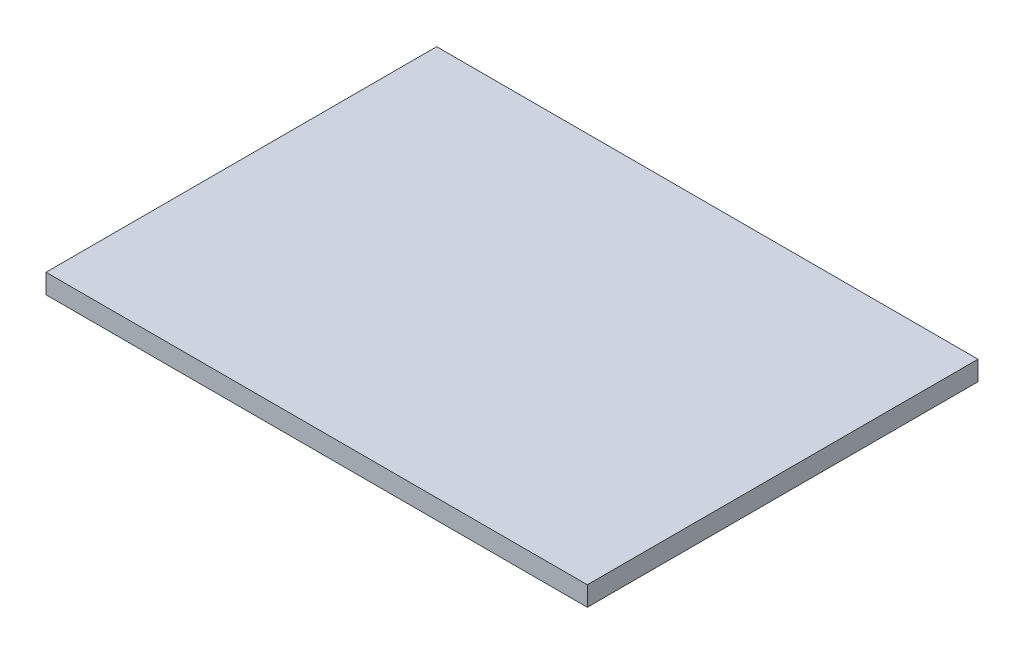
ISO-10303-21;
HEADER;
FILE_DESCRIPTION(('STEP AP214'),'2;1');
FILE_NAME('part.step','',(''),(''),'','','');
FILE_SCHEMA(('AUTOMOTIVE_DESIGN { 1 0 10303 214 1 1 1 1 }'));
ENDSEC;
DATA;
#1=APPLICATION_CONTEXT('core data for automotive mechanical design processes');
#2=APPLICATION_PROTOCOL_DEFINITION('international standard','automotive_design',2000,#1);
#3=PRODUCT_CONTEXT('',#1,'mechanical');
#4=PRODUCT('Part','Part','',(#3));
#5=PRODUCT_RELATED_PRODUCT_CATEGORY('part','',(#4));
#6=PRODUCT_DEFINITION_FORMATION('','',#4);
#7=PRODUCT_DEFINITION_CONTEXT('part definition',#1,'design');
#8=PRODUCT_DEFINITION('design','',#6,#7);
#9=PRODUCT_DEFINITION_SHAPE('','',#8);
#10=(LENGTH_UNIT() NAMED_UNIT(*) SI_UNIT(.MILLI.,.METRE.));
#11=(NAMED_UNIT(*) PLANE_ANGLE_UNIT() SI_UNIT($,.RADIAN.));
#12=(NAMED_UNIT(*) SI_UNIT($,.STERADIAN.) SOLID_ANGLE_UNIT());
#13=UNCERTAINTY_MEASURE_WITH_UNIT(LENGTH_MEASURE(1.E-05),#10,'distance_accuracy_value','');
#14=(GEOMETRIC_REPRESENTATION_CONTEXT(3) GLOBAL_UNCERTAINTY_ASSIGNED_CONTEXT((#13)) GLOBAL_UNIT_ASSIGNED_CONTEXT((#10,
#11,#12)) REPRESENTATION_CONTEXT('',''));
#15=CARTESIAN_POINT('',(0.,0.,0.));
#16=DIRECTION('',(0.,0.,1.));
#17=DIRECTION('',(1.,0.,0.));
#18=AXIS2_PLACEMENT_3D('',#15,#16,#17);
#19=CARTESIAN_POINT('',(-175.97628,6.35,-127.));
#20=DIRECTION('',(0.,0.,-1.));
#21=DIRECTION('',(-1.,0.,0.));
#22=AXIS2_PLACEMENT_3D('',#19,#20,#21);
#23=PLANE('',#22);
#24=DIRECTION('',(1.,0.,0.));
#25=VECTOR('',#24,1.);
#26=CARTESIAN_POINT('',(-175.97628,0.,-127.));
#27=LINE('',#26,#25);
#28=CARTESIAN_POINT('',(-175.97628,0.,-127.));
#29=VERTEX_POINT('',#28);
#30=CARTESIAN_POINT('',(0.,0.,-127.));
#31=VERTEX_POINT('',#30);
#32=EDGE_CURVE('E98',#29,#31,#27,.T.);
#33=ORIENTED_EDGE('',*,*,#32,.F.);
#34=DIRECTION('',(0.,-1.,0.));
#35=VECTOR('',#34,1.);
#36=CARTESIAN_POINT('',(-175.97628,6.35,-127.));
#37=LINE('',#36,#35);
#38=CARTESIAN_POINT('',(-175.97628,6.35,-127.));
#39=VERTEX_POINT('',#38);
#40=EDGE_CURVE('E11',#39,#29,#37,.T.);
#41=ORIENTED_EDGE('',*,*,#40,.F.);
#42=DIRECTION('',(1.,0.,0.));
#43=VECTOR('',#42,1.);
#44=CARTESIAN_POINT('',(-175.97628,6.35,-127.));
#45=LINE('',#44,#43);
#46=CARTESIAN_POINT('',(0.,6.35,-127.));
#47=VERTEX_POINT('',#46);
#48=EDGE_CURVE('E92',#39,#47,#45,.T.);
#49=ORIENTED_EDGE('',*,*,#48,.T.);
#50=DIRECTION('',(0.,-1.,0.));
#51=VECTOR('',#50,1.);
#52=CARTESIAN_POINT('',(0.,6.35,-127.));
#53=LINE('',#52,#51);
#54=EDGE_CURVE('E37',#47,#31,#53,.T.);
#55=ORIENTED_EDGE('',*,*,#54,.T.);
#56=EDGE_LOOP('',(#33,#41,#49,#55));
#57=FACE_BOUND('',#56,.T.);
#58=ADVANCED_FACE('F34',(#57),#23,.T.);
#59=CARTESIAN_POINT('',(-175.97628,6.35,0.));
#60=DIRECTION('',(-1.,0.,0.));
#61=DIRECTION('',(0.,0.,1.));
#62=AXIS2_PLACEMENT_3D('',#59,#60,#61);
#63=PLANE('',#62);
#64=DIRECTION('',(0.,0.,-1.));
#65=VECTOR('',#64,1.);
#66=CARTESIAN_POINT('',(-175.97628,0.,0.));
#67=LINE('',#66,#65);
#68=CARTESIAN_POINT('',(-175.97628,0.,0.));
#69=VERTEX_POINT('',#68);
#70=EDGE_CURVE('E94',#69,#29,#67,.T.);
#71=ORIENTED_EDGE('',*,*,#70,.F.);
#72=DIRECTION('',(0.,-1.,0.));
#73=VECTOR('',#72,1.);
#74=CARTESIAN_POINT('',(-175.97628,6.35,0.));
#75=LINE('',#74,#73);
#76=CARTESIAN_POINT('',(-175.97628,6.35,0.));
#77=VERTEX_POINT('',#76);
#78=EDGE_CURVE('E43',#77,#69,#75,.T.);
#79=ORIENTED_EDGE('',*,*,#78,.F.);
#80=DIRECTION('',(0.,0.,-1.));
#81=VECTOR('',#80,1.);
#82=CARTESIAN_POINT('',(-175.97628,6.35,0.));
#83=LINE('',#82,#81);
#84=EDGE_CURVE('E89',#77,#39,#83,.T.);
#85=ORIENTED_EDGE('',*,*,#84,.T.);
#86=ORIENTED_EDGE('',*,*,#40,.T.);
#87=EDGE_LOOP('',(#71,#79,#85,#86));
#88=FACE_BOUND('',#87,.T.);
#89=ADVANCED_FACE('F108',(#88),#63,.T.);
#90=CARTESIAN_POINT('',(0.,6.35,0.));
#91=DIRECTION('',(0.,0.,1.));
#92=DIRECTION('',(1.,0.,0.));
#93=AXIS2_PLACEMENT_3D('',#90,#91,#92);
#94=PLANE('',#93);
#95=DIRECTION('',(-1.,0.,0.));
#96=VECTOR('',#95,1.);
#97=CARTESIAN_POINT('',(0.,0.,0.));
#98=LINE('',#97,#96);
#99=CARTESIAN_POINT('',(0.,0.,0.));
#100=VERTEX_POINT('',#99);
#101=EDGE_CURVE('E84',#100,#69,#98,.T.);
#102=ORIENTED_EDGE('',*,*,#101,.F.);
#103=DIRECTION('',(0.,-1.,0.));
#104=VECTOR('',#103,1.);
#105=CARTESIAN_POINT('',(0.,6.35,0.));
#106=LINE('',#105,#104);
#107=CARTESIAN_POINT('',(0.,6.35,0.));
#108=VERTEX_POINT('',#107);
#109=EDGE_CURVE('E79',#108,#100,#106,.T.);
#110=ORIENTED_EDGE('',*,*,#109,.F.);
#111=DIRECTION('',(-1.,0.,0.));
#112=VECTOR('',#111,1.);
#113=CARTESIAN_POINT('',(0.,6.35,0.));
#114=LINE('',#113,#112);
#115=EDGE_CURVE('E82',#108,#77,#114,.T.);
#116=ORIENTED_EDGE('',*,*,#115,.T.);
#117=ORIENTED_EDGE('',*,*,#78,.T.);
#118=EDGE_LOOP('',(#102,#110,#116,#117));
#119=FACE_BOUND('',#118,.T.);
#120=ADVANCED_FACE('F81',(#119),#94,.T.);
#121=CARTESIAN_POINT('',(0.,6.35,-127.));
#122=DIRECTION('',(1.,0.,0.));
#123=DIRECTION('',(0.,0.,-1.));
#124=AXIS2_PLACEMENT_3D('',#121,#122,#123);
#125=PLANE('',#124);
#126=DIRECTION('',(0.,0.,1.));
#127=VECTOR('',#126,1.);
#128=CARTESIAN_POINT('',(0.,0.,-127.));
#129=LINE('',#128,#127);
#130=EDGE_CURVE('E101',#31,#100,#129,.T.);
#131=ORIENTED_EDGE('',*,*,#130,.F.);
#132=ORIENTED_EDGE('',*,*,#54,.F.);
#133=DIRECTION('',(0.,0.,1.));
#134=VECTOR('',#133,1.);
#135=CARTESIAN_POINT('',(0.,6.35,-127.));
#136=LINE('',#135,#134);
#137=EDGE_CURVE('E88',#47,#108,#136,.T.);
#138=ORIENTED_EDGE('',*,*,#137,.T.);
#139=ORIENTED_EDGE('',*,*,#109,.T.);
#140=EDGE_LOOP('',(#131,#132,#138,#139));
#141=FACE_BOUND('',#140,.T.);
#142=ADVANCED_FACE('F91',(#141),#125,.T.);
#143=CARTESIAN_POINT('',(0.,6.35,0.));
#144=DIRECTION('',(0.,-1.,0.));
#145=DIRECTION('',(0.,0.,-1.));
#146=AXIS2_PLACEMENT_3D('',#143,#144,#145);
#147=PLANE('',#146);
#148=ORIENTED_EDGE('',*,*,#48,.F.);
#149=ORIENTED_EDGE('',*,*,#84,.F.);
#150=ORIENTED_EDGE('',*,*,#115,.F.);
#151=ORIENTED_EDGE('',*,*,#137,.F.);
#152=EDGE_LOOP('',(#148,#149,#150,#151));
#153=FACE_BOUND('',#152,.T.);
#154=ADVANCED_FACE('F87',(#153),#147,.F.);
#155=CARTESIAN_POINT('',(0.,0.,0.));
#156=DIRECTION('',(0.,-1.,0.));
#157=DIRECTION('',(0.,0.,-1.));
#158=AXIS2_PLACEMENT_3D('',#155,#156,#157);
#159=PLANE('',#158);
#160=ORIENTED_EDGE('',*,*,#32,.T.);
#161=ORIENTED_EDGE('',*,*,#130,.T.);
#162=ORIENTED_EDGE('',*,*,#101,.T.);
#163=ORIENTED_EDGE('',*,*,#70,.T.);
#164=EDGE_LOOP('',(#160,#161,#162,#163));
#165=FACE_BOUND('',#164,.T.);
#166=ADVANCED_FACE('F107',(#165),#159,.T.);
#167=CLOSED_SHELL('',(#58,#89,#120,#142,#154,#166));
#168=MANIFOLD_SOLID_BREP('B2',#167);
#169=ADVANCED_BREP_SHAPE_REPRESENTATION('',(#18,#168),#14);
#170=SHAPE_DEFINITION_REPRESENTATION(#9,#169);
ENDSEC;
END-ISO-10303-21;
